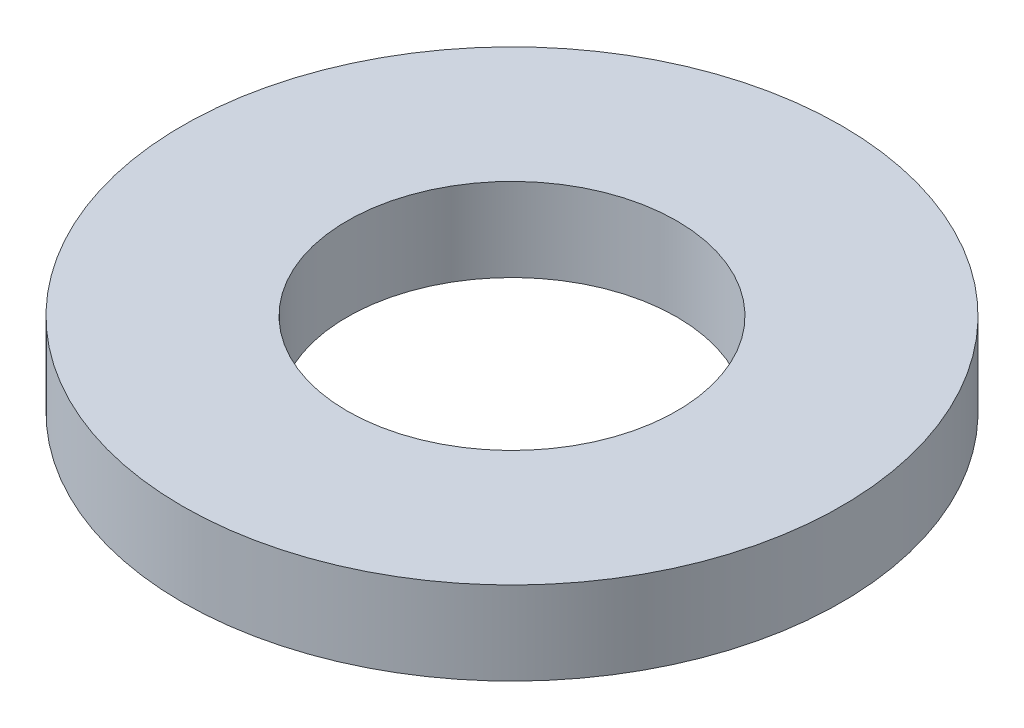
ISO-10303-21;
HEADER;
FILE_DESCRIPTION(('STEP AP214'),'2;1');
FILE_NAME('part.step','',(''),(''),'','','');
FILE_SCHEMA(('AUTOMOTIVE_DESIGN { 1 0 10303 214 1 1 1 1 }'));
ENDSEC;
DATA;
#1=APPLICATION_CONTEXT('core data for automotive mechanical design processes');
#2=APPLICATION_PROTOCOL_DEFINITION('international standard','automotive_design',2000,#1);
#3=PRODUCT_CONTEXT('',#1,'mechanical');
#4=PRODUCT('Part','Part','',(#3));
#5=PRODUCT_RELATED_PRODUCT_CATEGORY('part','',(#4));
#6=PRODUCT_DEFINITION_FORMATION('','',#4);
#7=PRODUCT_DEFINITION_CONTEXT('part definition',#1,'design');
#8=PRODUCT_DEFINITION('design','',#6,#7);
#9=PRODUCT_DEFINITION_SHAPE('','',#8);
#10=(LENGTH_UNIT() NAMED_UNIT(*) SI_UNIT(.MILLI.,.METRE.));
#11=(NAMED_UNIT(*) PLANE_ANGLE_UNIT() SI_UNIT($,.RADIAN.));
#12=(NAMED_UNIT(*) SI_UNIT($,.STERADIAN.) SOLID_ANGLE_UNIT());
#13=UNCERTAINTY_MEASURE_WITH_UNIT(LENGTH_MEASURE(1.E-05),#10,'distance_accuracy_value','');
#14=(GEOMETRIC_REPRESENTATION_CONTEXT(3) GLOBAL_UNCERTAINTY_ASSIGNED_CONTEXT((#13)) GLOBAL_UNIT_ASSIGNED_CONTEXT((#10,
#11,#12)) REPRESENTATION_CONTEXT('',''));
#15=CARTESIAN_POINT('',(0.,0.,0.));
#16=DIRECTION('',(0.,0.,1.));
#17=DIRECTION('',(1.,0.,0.));
#18=AXIS2_PLACEMENT_3D('',#15,#16,#17);
#19=CARTESIAN_POINT('',(0.,24.,0.));
#20=DIRECTION('',(0.,-1.,0.));
#21=DIRECTION('',(0.,0.,-1.));
#22=AXIS2_PLACEMENT_3D('',#19,#20,#21);
#23=CYLINDRICAL_SURFACE('',#22,95.);
#24=CARTESIAN_POINT('',(0.,24.,0.));
#25=DIRECTION('',(0.,1.,0.));
#26=DIRECTION('',(0.,0.,1.));
#27=AXIS2_PLACEMENT_3D('',#24,#25,#26);
#28=CIRCLE('',#27,95.);
#29=CARTESIAN_POINT('',(0.,24.,95.));
#30=VERTEX_POINT('',#29);
#31=EDGE_CURVE('E10',#30,#30,#28,.T.);
#32=ORIENTED_EDGE('',*,*,#31,.F.);
#33=EDGE_LOOP('',(#32));
#34=FACE_BOUND('',#33,.T.);
#35=CARTESIAN_POINT('',(0.,0.,0.));
#36=DIRECTION('',(0.,1.,0.));
#37=DIRECTION('',(0.,0.,1.));
#38=AXIS2_PLACEMENT_3D('',#35,#36,#37);
#39=CIRCLE('',#38,95.);
#40=CARTESIAN_POINT('',(0.,0.,95.));
#41=VERTEX_POINT('',#40);
#42=EDGE_CURVE('E37',#41,#41,#39,.T.);
#43=ORIENTED_EDGE('',*,*,#42,.T.);
#44=EDGE_LOOP('',(#43));
#45=FACE_BOUND('',#44,.T.);
#46=ADVANCED_FACE('F40',(#34,#45),#23,.T.);
#47=CARTESIAN_POINT('',(0.,24.,0.));
#48=DIRECTION('',(0.,1.,0.));
#49=DIRECTION('',(0.,0.,1.));
#50=AXIS2_PLACEMENT_3D('',#47,#48,#49);
#51=PLANE('',#50);
#52=CARTESIAN_POINT('',(0.,24.,0.));
#53=DIRECTION('',(0.,1.,0.));
#54=DIRECTION('',(0.,0.,1.));
#55=AXIS2_PLACEMENT_3D('',#52,#53,#54);
#56=CIRCLE('',#55,47.5);
#57=CARTESIAN_POINT('',(0.,24.,47.5));
#58=VERTEX_POINT('',#57);
#59=EDGE_CURVE('E50',#58,#58,#56,.T.);
#60=ORIENTED_EDGE('',*,*,#59,.F.);
#61=EDGE_LOOP('',(#60));
#62=FACE_BOUND('',#61,.T.);
#63=ORIENTED_EDGE('',*,*,#31,.T.);
#64=EDGE_LOOP('',(#63));
#65=FACE_BOUND('',#64,.T.);
#66=ADVANCED_FACE('F59',(#62,#65),#51,.T.);
#67=CARTESIAN_POINT('',(0.,0.,0.));
#68=DIRECTION('',(0.,1.,0.));
#69=DIRECTION('',(0.,0.,1.));
#70=AXIS2_PLACEMENT_3D('',#67,#68,#69);
#71=PLANE('',#70);
#72=CARTESIAN_POINT('',(0.,0.,0.));
#73=DIRECTION('',(0.,1.,0.));
#74=DIRECTION('',(0.,0.,1.));
#75=AXIS2_PLACEMENT_3D('',#72,#73,#74);
#76=CIRCLE('',#75,47.5);
#77=CARTESIAN_POINT('',(0.,0.,47.5));
#78=VERTEX_POINT('',#77);
#79=EDGE_CURVE('E47',#78,#78,#76,.T.);
#80=ORIENTED_EDGE('',*,*,#79,.T.);
#81=EDGE_LOOP('',(#80));
#82=FACE_BOUND('',#81,.T.);
#83=ORIENTED_EDGE('',*,*,#42,.F.);
#84=EDGE_LOOP('',(#83));
#85=FACE_BOUND('',#84,.T.);
#86=ADVANCED_FACE('F58',(#82,#85),#71,.F.);
#87=CARTESIAN_POINT('',(0.,24.,0.));
#88=DIRECTION('',(0.,-1.,0.));
#89=DIRECTION('',(0.,0.,-1.));
#90=AXIS2_PLACEMENT_3D('',#87,#88,#89);
#91=CYLINDRICAL_SURFACE('',#90,47.5);
#92=ORIENTED_EDGE('',*,*,#59,.T.);
#93=EDGE_LOOP('',(#92));
#94=FACE_BOUND('',#93,.T.);
#95=ORIENTED_EDGE('',*,*,#79,.F.);
#96=EDGE_LOOP('',(#95));
#97=FACE_BOUND('',#96,.T.);
#98=ADVANCED_FACE('F54',(#94,#97),#91,.F.);
#99=CLOSED_SHELL('',(#46,#66,#86,#98));
#100=MANIFOLD_SOLID_BREP('B2',#99);
#101=ADVANCED_BREP_SHAPE_REPRESENTATION('',(#18,#100),#14);
#102=SHAPE_DEFINITION_REPRESENTATION(#9,#101);
ENDSEC;
END-ISO-10303-21;
